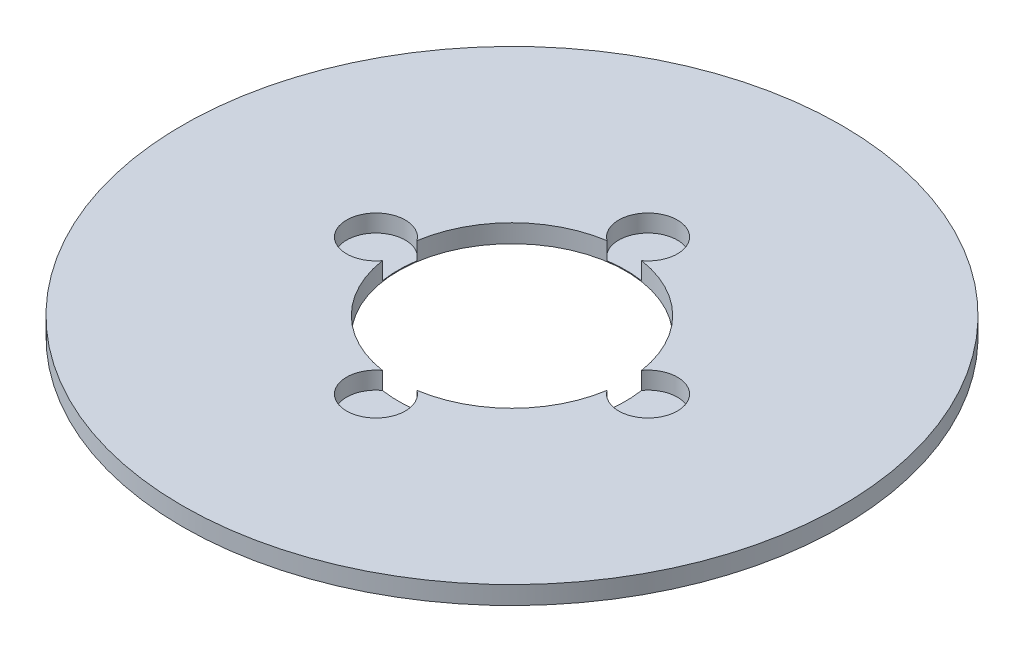
ISO-10303-21;
HEADER;
FILE_DESCRIPTION(('STEP AP214'),'2;1');
FILE_NAME('part.step','',(''),(''),'','','');
FILE_SCHEMA(('AUTOMOTIVE_DESIGN { 1 0 10303 214 1 1 1 1 }'));
ENDSEC;
DATA;
#1=APPLICATION_CONTEXT('core data for automotive mechanical design processes');
#2=APPLICATION_PROTOCOL_DEFINITION('international standard','automotive_design',2000,#1);
#3=PRODUCT_CONTEXT('',#1,'mechanical');
#4=PRODUCT('Part','Part','',(#3));
#5=PRODUCT_RELATED_PRODUCT_CATEGORY('part','',(#4));
#6=PRODUCT_DEFINITION_FORMATION('','',#4);
#7=PRODUCT_DEFINITION_CONTEXT('part definition',#1,'design');
#8=PRODUCT_DEFINITION('design','',#6,#7);
#9=PRODUCT_DEFINITION_SHAPE('','',#8);
#10=(LENGTH_UNIT() NAMED_UNIT(*) SI_UNIT(.MILLI.,.METRE.));
#11=(NAMED_UNIT(*) PLANE_ANGLE_UNIT() SI_UNIT($,.RADIAN.));
#12=(NAMED_UNIT(*) SI_UNIT($,.STERADIAN.) SOLID_ANGLE_UNIT());
#13=UNCERTAINTY_MEASURE_WITH_UNIT(LENGTH_MEASURE(1.E-05),#10,'distance_accuracy_value','');
#14=(GEOMETRIC_REPRESENTATION_CONTEXT(3) GLOBAL_UNCERTAINTY_ASSIGNED_CONTEXT((#13)) GLOBAL_UNIT_ASSIGNED_CONTEXT((#10,
#11,#12)) REPRESENTATION_CONTEXT('',''));
#15=CARTESIAN_POINT('',(0.,0.,0.));
#16=DIRECTION('',(0.,0.,1.));
#17=DIRECTION('',(1.,0.,0.));
#18=AXIS2_PLACEMENT_3D('',#15,#16,#17);
#19=CARTESIAN_POINT('',(0.,4.,0.));
#20=DIRECTION('',(0.,-1.,0.));
#21=DIRECTION('',(0.,0.,-1.));
#22=AXIS2_PLACEMENT_3D('',#19,#20,#21);
#23=CYLINDRICAL_SURFACE('',#22,72.5);
#24=CARTESIAN_POINT('',(0.,4.,0.));
#25=DIRECTION('',(0.,1.,0.));
#26=DIRECTION('',(0.,0.,1.));
#27=AXIS2_PLACEMENT_3D('',#24,#25,#26);
#28=CIRCLE('',#27,72.5);
#29=CARTESIAN_POINT('',(0.,4.,72.5));
#30=VERTEX_POINT('',#29);
#31=EDGE_CURVE('E145',#30,#30,#28,.T.);
#32=ORIENTED_EDGE('',*,*,#31,.F.);
#33=EDGE_LOOP('',(#32));
#34=FACE_BOUND('',#33,.T.);
#35=CARTESIAN_POINT('',(0.,0.,0.));
#36=DIRECTION('',(0.,1.,0.));
#37=DIRECTION('',(0.,0.,1.));
#38=AXIS2_PLACEMENT_3D('',#35,#36,#37);
#39=CIRCLE('',#38,72.5);
#40=CARTESIAN_POINT('',(0.,0.,72.5));
#41=VERTEX_POINT('',#40);
#42=EDGE_CURVE('E143',#41,#41,#39,.T.);
#43=ORIENTED_EDGE('',*,*,#42,.T.);
#44=EDGE_LOOP('',(#43));
#45=FACE_BOUND('',#44,.T.);
#46=ADVANCED_FACE('F39',(#34,#45),#23,.T.);
#47=CARTESIAN_POINT('',(0.,4.,0.));
#48=DIRECTION('',(0.,1.,0.));
#49=DIRECTION('',(0.,0.,1.));
#50=AXIS2_PLACEMENT_3D('',#47,#48,#49);
#51=PLANE('',#50);
#52=CARTESIAN_POINT('',(1.04501831807184E-13,4.,29.9305142045552));
#53=DIRECTION('',(0.,1.,0.));
#54=DIRECTION('',(1.,0.,0.));
#55=AXIS2_PLACEMENT_3D('',#52,#53,#54);
#56=CIRCLE('',#55,6.4603354231409);
#57=CARTESIAN_POINT('',(-3.8040249656687,4.,24.708893015685));
#58=VERTEX_POINT('',#57);
#59=CARTESIAN_POINT('',(3.80402496566888,4.,24.708893015685));
#60=VERTEX_POINT('',#59);
#61=EDGE_CURVE('E152',#58,#60,#56,.T.);
#62=ORIENTED_EDGE('',*,*,#61,.F.);
#63=CARTESIAN_POINT('',(0.,4.,0.));
#64=DIRECTION('',(0.,1.,0.));
#65=DIRECTION('',(0.,0.,1.));
#66=AXIS2_PLACEMENT_3D('',#63,#64,#65);
#67=CIRCLE('',#66,25.);
#68=CARTESIAN_POINT('',(-24.708893015685,4.,3.80402496566879));
#69=VERTEX_POINT('',#68);
#70=EDGE_CURVE('E133',#69,#58,#67,.T.);
#71=ORIENTED_EDGE('',*,*,#70,.F.);
#72=CARTESIAN_POINT('',(-29.9305142045552,4.,0.));
#73=DIRECTION('',(0.,1.,0.));
#74=DIRECTION('',(0.,0.,1.));
#75=AXIS2_PLACEMENT_3D('',#72,#73,#74);
#76=CIRCLE('',#75,6.4603354231409);
#77=CARTESIAN_POINT('',(-24.708893015685,4.,-3.80402496566879));
#78=VERTEX_POINT('',#77);
#79=EDGE_CURVE('E128',#78,#69,#76,.T.);
#80=ORIENTED_EDGE('',*,*,#79,.F.);
#81=CARTESIAN_POINT('',(-3.80402496566905,4.,-24.708893015685));
#82=VERTEX_POINT('',#81);
#83=EDGE_CURVE('E121',#82,#78,#67,.T.);
#84=ORIENTED_EDGE('',*,*,#83,.F.);
#85=CARTESIAN_POINT('',(-3.13505495421551E-13,4.,-29.9305142045552));
#86=DIRECTION('',(0.,1.,0.));
#87=DIRECTION('',(-1.,0.,0.));
#88=AXIS2_PLACEMENT_3D('',#85,#86,#87);
#89=CIRCLE('',#88,6.4603354231409);
#90=CARTESIAN_POINT('',(3.80402496566853,4.,-24.7088930156851));
#91=VERTEX_POINT('',#90);
#92=EDGE_CURVE('E105',#91,#82,#89,.T.);
#93=ORIENTED_EDGE('',*,*,#92,.F.);
#94=CARTESIAN_POINT('',(24.708893015685,4.,-3.80402496566879));
#95=VERTEX_POINT('',#94);
#96=EDGE_CURVE('E131',#95,#91,#67,.T.);
#97=ORIENTED_EDGE('',*,*,#96,.F.);
#98=CARTESIAN_POINT('',(29.9305142045552,4.,0.));
#99=DIRECTION('',(0.,1.,0.));
#100=DIRECTION('',(0.,0.,-1.));
#101=AXIS2_PLACEMENT_3D('',#98,#99,#100);
#102=CIRCLE('',#101,6.4603354231409);
#103=CARTESIAN_POINT('',(24.708893015685,4.,3.80402496566879));
#104=VERTEX_POINT('',#103);
#105=EDGE_CURVE('E154',#104,#95,#102,.T.);
#106=ORIENTED_EDGE('',*,*,#105,.F.);
#107=EDGE_CURVE('E134',#60,#104,#67,.T.);
#108=ORIENTED_EDGE('',*,*,#107,.F.);
#109=EDGE_LOOP('',(#62,#71,#80,#84,#93,#97,#106,#108));
#110=FACE_BOUND('',#109,.T.);
#111=ORIENTED_EDGE('',*,*,#31,.T.);
#112=EDGE_LOOP('',(#111));
#113=FACE_BOUND('',#112,.T.);
#114=ADVANCED_FACE('F130',(#110,#113),#51,.T.);
#115=CARTESIAN_POINT('',(0.,0.,0.));
#116=DIRECTION('',(0.,1.,0.));
#117=DIRECTION('',(0.,0.,1.));
#118=AXIS2_PLACEMENT_3D('',#115,#116,#117);
#119=PLANE('',#118);
#120=CARTESIAN_POINT('',(0.,0.,0.));
#121=DIRECTION('',(0.,1.,0.));
#122=DIRECTION('',(0.,0.,1.));
#123=AXIS2_PLACEMENT_3D('',#120,#121,#122);
#124=CIRCLE('',#123,25.);
#125=CARTESIAN_POINT('',(0.,0.,25.));
#126=VERTEX_POINT('',#125);
#127=EDGE_CURVE('E135',#126,#126,#124,.T.);
#128=ORIENTED_EDGE('',*,*,#127,.T.);
#129=EDGE_LOOP('',(#128));
#130=FACE_BOUND('',#129,.T.);
#131=ORIENTED_EDGE('',*,*,#42,.F.);
#132=EDGE_LOOP('',(#131));
#133=FACE_BOUND('',#132,.T.);
#134=ADVANCED_FACE('F195',(#130,#133),#119,.F.);
#135=CARTESIAN_POINT('',(0.,4.,0.));
#136=DIRECTION('',(0.,-1.,0.));
#137=DIRECTION('',(0.,0.,-1.));
#138=AXIS2_PLACEMENT_3D('',#135,#136,#137);
#139=CYLINDRICAL_SURFACE('',#138,25.);
#140=DIRECTION('',(0.,1.,0.));
#141=VECTOR('',#140,1.);
#142=CARTESIAN_POINT('',(-3.80402496566872,2.08695638973975,24.7088930156851));
#143=LINE('',#142,#141);
#144=CARTESIAN_POINT('',(-3.8040249656687,0.173912779479497,24.708893015685));
#145=VERTEX_POINT('',#144);
#146=EDGE_CURVE('E11',#145,#58,#143,.T.);
#147=ORIENTED_EDGE('',*,*,#146,.F.);
#148=CARTESIAN_POINT('',(0.,0.173912779479497,0.));
#149=DIRECTION('',(0.,1.,0.));
#150=DIRECTION('',(0.,0.,1.));
#151=AXIS2_PLACEMENT_3D('',#148,#149,#150);
#152=CIRCLE('',#151,25.);
#153=CARTESIAN_POINT('',(3.80402496566888,0.173912779479497,24.708893015685));
#154=VERTEX_POINT('',#153);
#155=EDGE_CURVE('E169',#145,#154,#152,.T.);
#156=ORIENTED_EDGE('',*,*,#155,.T.);
#157=DIRECTION('',(0.,1.,0.));
#158=VECTOR('',#157,1.);
#159=CARTESIAN_POINT('',(3.80402496566889,2.08695638973975,24.708893015685));
#160=LINE('',#159,#158);
#161=EDGE_CURVE('E46',#60,#154,#160,.F.);
#162=ORIENTED_EDGE('',*,*,#161,.F.);
#163=ORIENTED_EDGE('',*,*,#107,.T.);
#164=DIRECTION('',(0.,1.,0.));
#165=VECTOR('',#164,1.);
#166=CARTESIAN_POINT('',(24.708893015685,2.08695638973975,3.8040249656688));
#167=LINE('',#166,#165);
#168=CARTESIAN_POINT('',(24.708893015685,0.173912779479497,3.80402496566879));
#169=VERTEX_POINT('',#168);
#170=EDGE_CURVE('E151',#169,#104,#167,.T.);
#171=ORIENTED_EDGE('',*,*,#170,.F.);
#172=CARTESIAN_POINT('',(0.,0.173912779479497,0.));
#173=DIRECTION('',(0.,1.,0.));
#174=DIRECTION('',(0.,0.,1.));
#175=AXIS2_PLACEMENT_3D('',#172,#173,#174);
#176=CIRCLE('',#175,25.);
#177=CARTESIAN_POINT('',(24.708893015685,0.173912779479497,-3.80402496566879));
#178=VERTEX_POINT('',#177);
#179=EDGE_CURVE('E173',#169,#178,#176,.T.);
#180=ORIENTED_EDGE('',*,*,#179,.T.);
#181=DIRECTION('',(0.,1.,0.));
#182=VECTOR('',#181,1.);
#183=CARTESIAN_POINT('',(24.708893015685,2.08695638973975,-3.8040249656688));
#184=LINE('',#183,#182);
#185=EDGE_CURVE('E168',#95,#178,#184,.F.);
#186=ORIENTED_EDGE('',*,*,#185,.F.);
#187=ORIENTED_EDGE('',*,*,#96,.T.);
#188=DIRECTION('',(0.,1.,0.));
#189=VECTOR('',#188,1.);
#190=CARTESIAN_POINT('',(3.80402496566854,2.08695638973975,-24.7088930156851));
#191=LINE('',#190,#189);
#192=CARTESIAN_POINT('',(3.80402496566853,0.173912779479497,-24.7088930156851));
#193=VERTEX_POINT('',#192);
#194=EDGE_CURVE('E108',#193,#91,#191,.T.);
#195=ORIENTED_EDGE('',*,*,#194,.F.);
#196=CARTESIAN_POINT('',(0.,0.173912779479497,0.));
#197=DIRECTION('',(0.,1.,0.));
#198=DIRECTION('',(0.,0.,1.));
#199=AXIS2_PLACEMENT_3D('',#196,#197,#198);
#200=CIRCLE('',#199,25.);
#201=CARTESIAN_POINT('',(-3.80402496566905,0.173912779479497,-24.708893015685));
#202=VERTEX_POINT('',#201);
#203=EDGE_CURVE('E122',#193,#202,#200,.T.);
#204=ORIENTED_EDGE('',*,*,#203,.T.);
#205=DIRECTION('',(0.,1.,0.));
#206=VECTOR('',#205,1.);
#207=CARTESIAN_POINT('',(-3.80402496566906,2.08695638973975,-24.708893015685));
#208=LINE('',#207,#206);
#209=EDGE_CURVE('E106',#82,#202,#208,.F.);
#210=ORIENTED_EDGE('',*,*,#209,.F.);
#211=ORIENTED_EDGE('',*,*,#83,.T.);
#212=DIRECTION('',(0.,1.,0.));
#213=VECTOR('',#212,1.);
#214=CARTESIAN_POINT('',(-24.708893015685,2.08695638973975,-3.8040249656688));
#215=LINE('',#214,#213);
#216=CARTESIAN_POINT('',(-24.708893015685,0.173912779479497,-3.80402496566879));
#217=VERTEX_POINT('',#216);
#218=EDGE_CURVE('E177',#217,#78,#215,.T.);
#219=ORIENTED_EDGE('',*,*,#218,.F.);
#220=CARTESIAN_POINT('',(0.,0.173912779479497,0.));
#221=DIRECTION('',(0.,1.,0.));
#222=DIRECTION('',(0.,0.,1.));
#223=AXIS2_PLACEMENT_3D('',#220,#221,#222);
#224=CIRCLE('',#223,25.);
#225=CARTESIAN_POINT('',(-24.708893015685,0.173912779479497,3.80402496566879));
#226=VERTEX_POINT('',#225);
#227=EDGE_CURVE('E185',#217,#226,#224,.T.);
#228=ORIENTED_EDGE('',*,*,#227,.T.);
#229=DIRECTION('',(0.,1.,0.));
#230=VECTOR('',#229,1.);
#231=CARTESIAN_POINT('',(-24.708893015685,2.08695638973975,3.8040249656688));
#232=LINE('',#231,#230);
#233=EDGE_CURVE('E179',#69,#226,#232,.F.);
#234=ORIENTED_EDGE('',*,*,#233,.F.);
#235=ORIENTED_EDGE('',*,*,#70,.T.);
#236=EDGE_LOOP('',(#147,#156,#162,#163,#171,#180,#186,#187,#195,#204,#210,#211,#219,#228,#234,#235));
#237=FACE_BOUND('',#236,.T.);
#238=ORIENTED_EDGE('',*,*,#127,.F.);
#239=EDGE_LOOP('',(#238));
#240=FACE_BOUND('',#239,.T.);
#241=ADVANCED_FACE('F117',(#237,#240),#139,.F.);
#242=CARTESIAN_POINT('',(-29.9305142045552,0.173912779479497,0.));
#243=DIRECTION('',(0.,1.,0.));
#244=DIRECTION('',(0.,0.,1.));
#245=AXIS2_PLACEMENT_3D('',#242,#243,#244);
#246=CYLINDRICAL_SURFACE('',#245,6.4603354231409);
#247=ORIENTED_EDGE('',*,*,#218,.T.);
#248=ORIENTED_EDGE('',*,*,#79,.T.);
#249=ORIENTED_EDGE('',*,*,#233,.T.);
#250=CARTESIAN_POINT('',(-29.9305142045552,0.173912779479497,0.));
#251=DIRECTION('',(0.,1.,0.));
#252=DIRECTION('',(0.,0.,1.));
#253=AXIS2_PLACEMENT_3D('',#250,#251,#252);
#254=CIRCLE('',#253,6.4603354231409);
#255=EDGE_CURVE('E140',#217,#226,#254,.T.);
#256=ORIENTED_EDGE('',*,*,#255,.F.);
#257=EDGE_LOOP('',(#247,#248,#249,#256));
#258=FACE_BOUND('',#257,.T.);
#259=ADVANCED_FACE('F200',(#258),#246,.F.);
#260=CARTESIAN_POINT('',(-29.9305142045552,0.173912779479497,0.));
#261=DIRECTION('',(0.,1.,0.));
#262=DIRECTION('',(0.,0.,1.));
#263=AXIS2_PLACEMENT_3D('',#260,#261,#262);
#264=PLANE('',#263);
#265=ORIENTED_EDGE('',*,*,#255,.T.);
#266=ORIENTED_EDGE('',*,*,#227,.F.);
#267=EDGE_LOOP('',(#265,#266));
#268=FACE_BOUND('',#267,.T.);
#269=ADVANCED_FACE('F202',(#268),#264,.T.);
#270=CARTESIAN_POINT('',(-3.13505495421551E-13,0.173912779479497,-29.9305142045552));
#271=DIRECTION('',(0.,1.,0.));
#272=DIRECTION('',(0.,0.,1.));
#273=AXIS2_PLACEMENT_3D('',#270,#271,#272);
#274=CYLINDRICAL_SURFACE('',#273,6.4603354231409);
#275=ORIENTED_EDGE('',*,*,#194,.T.);
#276=ORIENTED_EDGE('',*,*,#92,.T.);
#277=ORIENTED_EDGE('',*,*,#209,.T.);
#278=CARTESIAN_POINT('',(-3.13505495421551E-13,0.173912779479497,-29.9305142045552));
#279=DIRECTION('',(0.,1.,0.));
#280=DIRECTION('',(-1.,0.,0.));
#281=AXIS2_PLACEMENT_3D('',#278,#279,#280);
#282=CIRCLE('',#281,6.4603354231409);
#283=EDGE_CURVE('E111',#193,#202,#282,.T.);
#284=ORIENTED_EDGE('',*,*,#283,.F.);
#285=EDGE_LOOP('',(#275,#276,#277,#284));
#286=FACE_BOUND('',#285,.T.);
#287=ADVANCED_FACE('F102',(#286),#274,.F.);
#288=CARTESIAN_POINT('',(-3.13505495421551E-13,0.173912779479497,-29.9305142045552));
#289=DIRECTION('',(0.,1.,0.));
#290=DIRECTION('',(-1.,0.,0.));
#291=AXIS2_PLACEMENT_3D('',#288,#289,#290);
#292=PLANE('',#291);
#293=ORIENTED_EDGE('',*,*,#283,.T.);
#294=ORIENTED_EDGE('',*,*,#203,.F.);
#295=EDGE_LOOP('',(#293,#294));
#296=FACE_BOUND('',#295,.T.);
#297=ADVANCED_FACE('F211',(#296),#292,.T.);
#298=CARTESIAN_POINT('',(29.9305142045552,0.173912779479497,0.));
#299=DIRECTION('',(0.,1.,0.));
#300=DIRECTION('',(0.,0.,1.));
#301=AXIS2_PLACEMENT_3D('',#298,#299,#300);
#302=CYLINDRICAL_SURFACE('',#301,6.4603354231409);
#303=ORIENTED_EDGE('',*,*,#170,.T.);
#304=ORIENTED_EDGE('',*,*,#105,.T.);
#305=ORIENTED_EDGE('',*,*,#185,.T.);
#306=CARTESIAN_POINT('',(29.9305142045552,0.173912779479497,0.));
#307=DIRECTION('',(0.,1.,0.));
#308=DIRECTION('',(0.,0.,-1.));
#309=AXIS2_PLACEMENT_3D('',#306,#307,#308);
#310=CIRCLE('',#309,6.4603354231409);
#311=EDGE_CURVE('E56',#169,#178,#310,.T.);
#312=ORIENTED_EDGE('',*,*,#311,.F.);
#313=EDGE_LOOP('',(#303,#304,#305,#312));
#314=FACE_BOUND('',#313,.T.);
#315=ADVANCED_FACE('F212',(#314),#302,.F.);
#316=CARTESIAN_POINT('',(29.9305142045552,0.173912779479497,0.));
#317=DIRECTION('',(0.,1.,0.));
#318=DIRECTION('',(0.,0.,-1.));
#319=AXIS2_PLACEMENT_3D('',#316,#317,#318);
#320=PLANE('',#319);
#321=ORIENTED_EDGE('',*,*,#311,.T.);
#322=ORIENTED_EDGE('',*,*,#179,.F.);
#323=EDGE_LOOP('',(#321,#322));
#324=FACE_BOUND('',#323,.T.);
#325=ADVANCED_FACE('F217',(#324),#320,.T.);
#326=CARTESIAN_POINT('',(1.04501831807184E-13,0.173912779479497,29.9305142045552));
#327=DIRECTION('',(0.,1.,0.));
#328=DIRECTION('',(0.,0.,1.));
#329=AXIS2_PLACEMENT_3D('',#326,#327,#328);
#330=CYLINDRICAL_SURFACE('',#329,6.4603354231409);
#331=ORIENTED_EDGE('',*,*,#146,.T.);
#332=ORIENTED_EDGE('',*,*,#61,.T.);
#333=ORIENTED_EDGE('',*,*,#161,.T.);
#334=CARTESIAN_POINT('',(1.04501831807184E-13,0.173912779479497,29.9305142045552));
#335=DIRECTION('',(0.,1.,0.));
#336=DIRECTION('',(1.,0.,0.));
#337=AXIS2_PLACEMENT_3D('',#334,#335,#336);
#338=CIRCLE('',#337,6.4603354231409);
#339=EDGE_CURVE('E55',#145,#154,#338,.T.);
#340=ORIENTED_EDGE('',*,*,#339,.F.);
#341=EDGE_LOOP('',(#331,#332,#333,#340));
#342=FACE_BOUND('',#341,.T.);
#343=ADVANCED_FACE('F170',(#342),#330,.F.);
#344=CARTESIAN_POINT('',(1.04501831807184E-13,0.173912779479497,29.9305142045552));
#345=DIRECTION('',(0.,1.,0.));
#346=DIRECTION('',(1.,0.,0.));
#347=AXIS2_PLACEMENT_3D('',#344,#345,#346);
#348=PLANE('',#347);
#349=ORIENTED_EDGE('',*,*,#339,.T.);
#350=ORIENTED_EDGE('',*,*,#155,.F.);
#351=EDGE_LOOP('',(#349,#350));
#352=FACE_BOUND('',#351,.T.);
#353=ADVANCED_FACE('F224',(#352),#348,.T.);
#354=CLOSED_SHELL('',(#46,#114,#134,#241,#259,#269,#287,#297,#315,#325,#343,#353));
#355=MANIFOLD_SOLID_BREP('B2',#354);
#356=ADVANCED_BREP_SHAPE_REPRESENTATION('',(#18,#355),#14);
#357=SHAPE_DEFINITION_REPRESENTATION(#9,#356);
ENDSEC;
END-ISO-10303-21;
